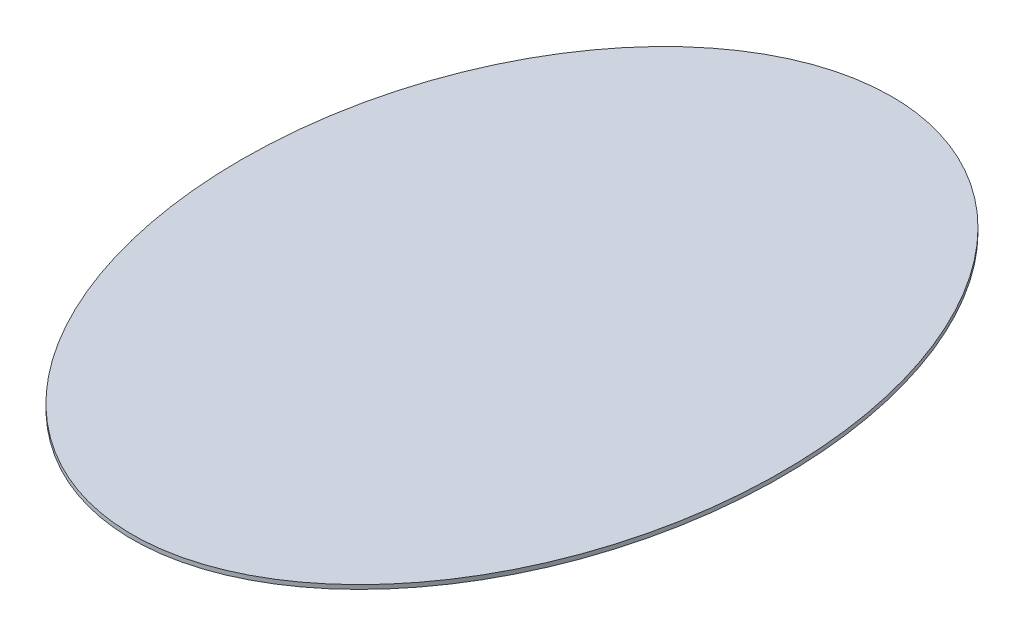
ISO-10303-21;
HEADER;
FILE_DESCRIPTION(('STEP AP214'),'2;1');
FILE_NAME('part.step','',(''),(''),'','','');
FILE_SCHEMA(('AUTOMOTIVE_DESIGN { 1 0 10303 214 1 1 1 1 }'));
ENDSEC;
DATA;
#1=APPLICATION_CONTEXT('core data for automotive mechanical design processes');
#2=APPLICATION_PROTOCOL_DEFINITION('international standard','automotive_design',2000,#1);
#3=PRODUCT_CONTEXT('',#1,'mechanical');
#4=PRODUCT('Part','Part','',(#3));
#5=PRODUCT_RELATED_PRODUCT_CATEGORY('part','',(#4));
#6=PRODUCT_DEFINITION_FORMATION('','',#4);
#7=PRODUCT_DEFINITION_CONTEXT('part definition',#1,'design');
#8=PRODUCT_DEFINITION('design','',#6,#7);
#9=PRODUCT_DEFINITION_SHAPE('','',#8);
#10=(LENGTH_UNIT() NAMED_UNIT(*) SI_UNIT(.MILLI.,.METRE.));
#11=(NAMED_UNIT(*) PLANE_ANGLE_UNIT() SI_UNIT($,.RADIAN.));
#12=(NAMED_UNIT(*) SI_UNIT($,.STERADIAN.) SOLID_ANGLE_UNIT());
#13=UNCERTAINTY_MEASURE_WITH_UNIT(LENGTH_MEASURE(1.E-05),#10,'distance_accuracy_value','');
#14=(GEOMETRIC_REPRESENTATION_CONTEXT(3) GLOBAL_UNCERTAINTY_ASSIGNED_CONTEXT((#13)) GLOBAL_UNIT_ASSIGNED_CONTEXT((#10,
#11,#12)) REPRESENTATION_CONTEXT('',''));
#15=CARTESIAN_POINT('',(0.,0.,0.));
#16=DIRECTION('',(0.,0.,1.));
#17=DIRECTION('',(1.,0.,0.));
#18=AXIS2_PLACEMENT_3D('',#15,#16,#17);
#19=CARTESIAN_POINT('',(0.,4.,0.));
#20=DIRECTION('',(0.,1.,0.));
#21=DIRECTION('',(0.,0.,-1.));
#22=AXIS2_PLACEMENT_3D('',#19,#20,#21);
#23=ELLIPSE('',#22,365.,260.);
#24=DIRECTION('',(0.,-1.,0.));
#25=VECTOR('',#24,1.);
#26=SURFACE_OF_LINEAR_EXTRUSION('',#23,#25);
#27=CARTESIAN_POINT('',(0.,4.,-365.));
#28=VERTEX_POINT('',#27);
#29=EDGE_CURVE('E10',#28,#28,#23,.T.);
#30=ORIENTED_EDGE('',*,*,#29,.F.);
#31=EDGE_LOOP('',(#30));
#32=FACE_BOUND('',#31,.T.);
#33=CARTESIAN_POINT('',(0.,0.,0.));
#34=DIRECTION('',(0.,1.,0.));
#35=DIRECTION('',(0.,0.,-1.));
#36=AXIS2_PLACEMENT_3D('',#33,#34,#35);
#37=ELLIPSE('',#36,365.,260.);
#38=CARTESIAN_POINT('',(0.,0.,-365.));
#39=VERTEX_POINT('',#38);
#40=EDGE_CURVE('E35',#39,#39,#37,.T.);
#41=ORIENTED_EDGE('',*,*,#40,.T.);
#42=EDGE_LOOP('',(#41));
#43=FACE_BOUND('',#42,.T.);
#44=ADVANCED_FACE('F31',(#32,#43),#26,.F.);
#45=CARTESIAN_POINT('',(0.,4.,0.));
#46=DIRECTION('',(0.,1.,0.));
#47=DIRECTION('',(0.,0.,1.));
#48=AXIS2_PLACEMENT_3D('',#45,#46,#47);
#49=PLANE('',#48);
#50=ORIENTED_EDGE('',*,*,#29,.T.);
#51=EDGE_LOOP('',(#50));
#52=FACE_BOUND('',#51,.T.);
#53=ADVANCED_FACE('F47',(#52),#49,.T.);
#54=CARTESIAN_POINT('',(0.,0.,0.));
#55=DIRECTION('',(0.,1.,0.));
#56=DIRECTION('',(0.,0.,1.));
#57=AXIS2_PLACEMENT_3D('',#54,#55,#56);
#58=PLANE('',#57);
#59=ORIENTED_EDGE('',*,*,#40,.F.);
#60=EDGE_LOOP('',(#59));
#61=FACE_BOUND('',#60,.T.);
#62=ADVANCED_FACE('F45',(#61),#58,.F.);
#63=CLOSED_SHELL('',(#44,#53,#62));
#64=MANIFOLD_SOLID_BREP('B2',#63);
#65=ADVANCED_BREP_SHAPE_REPRESENTATION('',(#18,#64),#14);
#66=SHAPE_DEFINITION_REPRESENTATION(#9,#65);
ENDSEC;
END-ISO-10303-21;
